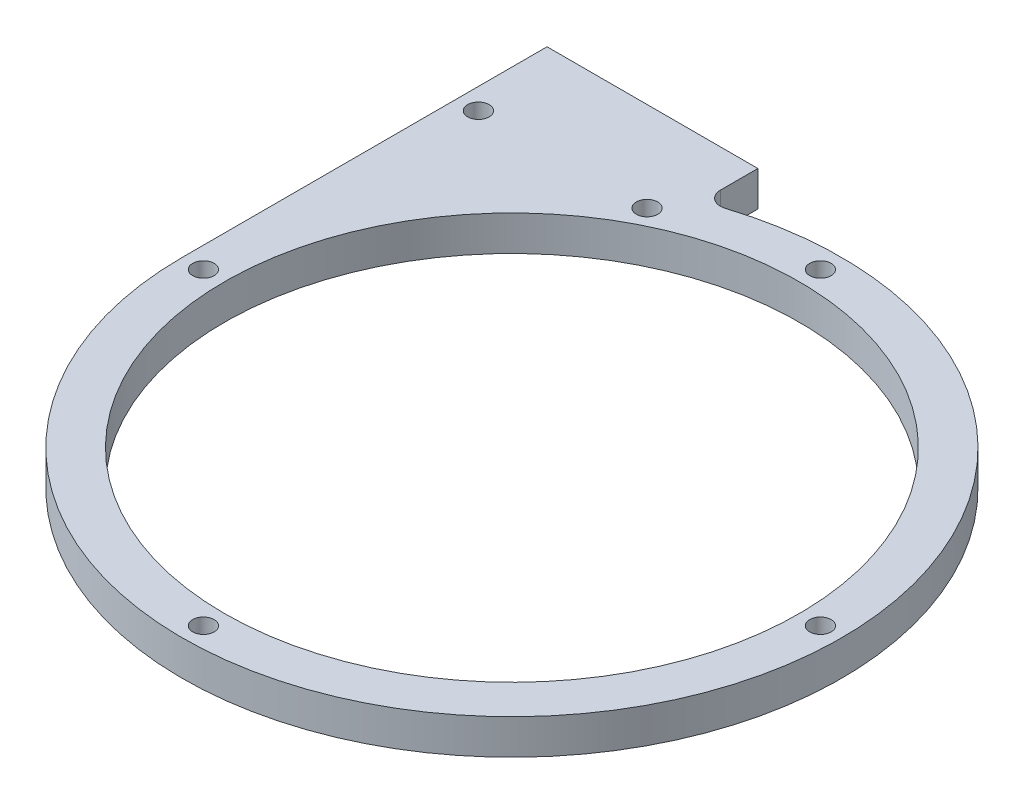
ISO-10303-21;
HEADER;
FILE_DESCRIPTION(('STEP AP214'),'2;1');
FILE_NAME('part.step','',(''),(''),'','','');
FILE_SCHEMA(('AUTOMOTIVE_DESIGN { 1 0 10303 214 1 1 1 1 }'));
ENDSEC;
DATA;
#1=APPLICATION_CONTEXT('core data for automotive mechanical design processes');
#2=APPLICATION_PROTOCOL_DEFINITION('international standard','automotive_design',2000,#1);
#3=PRODUCT_CONTEXT('',#1,'mechanical');
#4=PRODUCT('Part','Part','',(#3));
#5=PRODUCT_RELATED_PRODUCT_CATEGORY('part','',(#4));
#6=PRODUCT_DEFINITION_FORMATION('','',#4);
#7=PRODUCT_DEFINITION_CONTEXT('part definition',#1,'design');
#8=PRODUCT_DEFINITION('design','',#6,#7);
#9=PRODUCT_DEFINITION_SHAPE('','',#8);
#10=(LENGTH_UNIT() NAMED_UNIT(*) SI_UNIT(.MILLI.,.METRE.));
#11=(NAMED_UNIT(*) PLANE_ANGLE_UNIT() SI_UNIT($,.RADIAN.));
#12=(NAMED_UNIT(*) SI_UNIT($,.STERADIAN.) SOLID_ANGLE_UNIT());
#13=UNCERTAINTY_MEASURE_WITH_UNIT(LENGTH_MEASURE(1.E-05),#10,'distance_accuracy_value','');
#14=(GEOMETRIC_REPRESENTATION_CONTEXT(3) GLOBAL_UNCERTAINTY_ASSIGNED_CONTEXT((#13)) GLOBAL_UNIT_ASSIGNED_CONTEXT((#10,
#11,#12)) REPRESENTATION_CONTEXT('',''));
#15=CARTESIAN_POINT('',(0.,0.,0.));
#16=DIRECTION('',(0.,0.,1.));
#17=DIRECTION('',(1.,0.,0.));
#18=AXIS2_PLACEMENT_3D('',#15,#16,#17);
#19=CARTESIAN_POINT('',(0.,5.,0.));
#20=DIRECTION('',(0.,1.,0.));
#21=DIRECTION('',(0.,0.,1.));
#22=AXIS2_PLACEMENT_3D('',#19,#20,#21);
#23=PLANE('',#22);
#24=CARTESIAN_POINT('',(-43.9,5.,0.));
#25=DIRECTION('',(0.,1.,0.));
#26=DIRECTION('',(0.,0.,1.));
#27=AXIS2_PLACEMENT_3D('',#24,#25,#26);
#28=CIRCLE('',#27,1.525);
#29=CARTESIAN_POINT('',(-43.9,5.,1.525));
#30=VERTEX_POINT('',#29);
#31=EDGE_CURVE('E116',#30,#30,#28,.T.);
#32=ORIENTED_EDGE('',*,*,#31,.F.);
#33=EDGE_LOOP('',(#32));
#34=FACE_BOUND('',#33,.T.);
#35=CARTESIAN_POINT('',(43.9,5.,0.));
#36=DIRECTION('',(0.,1.,0.));
#37=DIRECTION('',(0.,0.,1.));
#38=AXIS2_PLACEMENT_3D('',#35,#36,#37);
#39=CIRCLE('',#38,1.525);
#40=CARTESIAN_POINT('',(43.9,5.,1.52500000000001));
#41=VERTEX_POINT('',#40);
#42=EDGE_CURVE('E128',#41,#41,#39,.T.);
#43=ORIENTED_EDGE('',*,*,#42,.F.);
#44=EDGE_LOOP('',(#43));
#45=FACE_BOUND('',#44,.T.);
#46=CARTESIAN_POINT('',(-19.9,5.,-39.1305507244659));
#47=DIRECTION('',(0.,1.,0.));
#48=DIRECTION('',(0.,0.,1.));
#49=AXIS2_PLACEMENT_3D('',#46,#47,#48);
#50=CIRCLE('',#49,1.525);
#51=CARTESIAN_POINT('',(-19.9,5.,-37.6055507244659));
#52=VERTEX_POINT('',#51);
#53=EDGE_CURVE('E140',#52,#52,#50,.T.);
#54=ORIENTED_EDGE('',*,*,#53,.F.);
#55=EDGE_LOOP('',(#54));
#56=FACE_BOUND('',#55,.T.);
#57=CARTESIAN_POINT('',(0.,5.,0.));
#58=DIRECTION('',(0.,1.,0.));
#59=DIRECTION('',(0.,0.,1.));
#60=AXIS2_PLACEMENT_3D('',#57,#58,#59);
#61=CIRCLE('',#60,46.9);
#62=CARTESIAN_POINT('',(-46.9,5.,0.));
#63=VERTEX_POINT('',#62);
#64=CARTESIAN_POINT('',(-14.2905930470348,5.,-44.6697766992856));
#65=VERTEX_POINT('',#64);
#66=EDGE_CURVE('E152',#63,#65,#61,.T.);
#67=ORIENTED_EDGE('',*,*,#66,.T.);
#68=CARTESIAN_POINT('',(-14.9,5.,-46.5746712280398));
#69=DIRECTION('',(0.,-1.,0.));
#70=DIRECTION('',(0.,0.,1.));
#71=AXIS2_PLACEMENT_3D('',#68,#69,#70);
#72=CIRCLE('',#71,2.00000000000001);
#73=CARTESIAN_POINT('',(-16.9,5.,-46.5746712280398));
#74=VERTEX_POINT('',#73);
#75=EDGE_CURVE('E74',#65,#74,#72,.T.);
#76=ORIENTED_EDGE('',*,*,#75,.T.);
#77=DIRECTION('',(0.,0.,-1.));
#78=VECTOR('',#77,1.);
#79=CARTESIAN_POINT('',(-16.9,5.,-46.9));
#80=LINE('',#79,#78);
#81=CARTESIAN_POINT('',(-16.9,5.,-51.9));
#82=VERTEX_POINT('',#81);
#83=EDGE_CURVE('E85',#74,#82,#80,.T.);
#84=ORIENTED_EDGE('',*,*,#83,.T.);
#85=DIRECTION('',(-1.,0.,0.));
#86=VECTOR('',#85,1.);
#87=CARTESIAN_POINT('',(-46.9,5.,-51.9));
#88=LINE('',#87,#86);
#89=CARTESIAN_POINT('',(-46.9,5.,-51.9));
#90=VERTEX_POINT('',#89);
#91=EDGE_CURVE('E89',#82,#90,#88,.T.);
#92=ORIENTED_EDGE('',*,*,#91,.T.);
#93=DIRECTION('',(0.,0.,1.));
#94=VECTOR('',#93,1.);
#95=CARTESIAN_POINT('',(-46.9,5.,0.));
#96=LINE('',#95,#94);
#97=EDGE_CURVE('E51',#90,#63,#96,.T.);
#98=ORIENTED_EDGE('',*,*,#97,.T.);
#99=EDGE_LOOP('',(#67,#76,#84,#92,#98));
#100=FACE_BOUND('',#99,.T.);
#101=CARTESIAN_POINT('',(0.,5.,0.));
#102=DIRECTION('',(0.,1.,0.));
#103=DIRECTION('',(0.,0.,1.));
#104=AXIS2_PLACEMENT_3D('',#101,#102,#103);
#105=CIRCLE('',#104,40.9);
#106=CARTESIAN_POINT('',(0.,5.,40.9));
#107=VERTEX_POINT('',#106);
#108=EDGE_CURVE('E146',#107,#107,#105,.T.);
#109=ORIENTED_EDGE('',*,*,#108,.F.);
#110=EDGE_LOOP('',(#109));
#111=FACE_BOUND('',#110,.T.);
#112=CARTESIAN_POINT('',(0.,5.,-43.9));
#113=DIRECTION('',(0.,1.,0.));
#114=DIRECTION('',(0.,0.,1.));
#115=AXIS2_PLACEMENT_3D('',#112,#113,#114);
#116=CIRCLE('',#115,1.525);
#117=CARTESIAN_POINT('',(0.,5.,-42.375));
#118=VERTEX_POINT('',#117);
#119=EDGE_CURVE('E134',#118,#118,#116,.T.);
#120=ORIENTED_EDGE('',*,*,#119,.F.);
#121=EDGE_LOOP('',(#120));
#122=FACE_BOUND('',#121,.T.);
#123=CARTESIAN_POINT('',(0.,5.,43.9));
#124=DIRECTION('',(0.,1.,0.));
#125=DIRECTION('',(0.,0.,1.));
#126=AXIS2_PLACEMENT_3D('',#123,#124,#125);
#127=CIRCLE('',#126,1.525);
#128=CARTESIAN_POINT('',(0.,5.,45.425));
#129=VERTEX_POINT('',#128);
#130=EDGE_CURVE('E122',#129,#129,#127,.T.);
#131=ORIENTED_EDGE('',*,*,#130,.F.);
#132=EDGE_LOOP('',(#131));
#133=FACE_BOUND('',#132,.T.);
#134=CARTESIAN_POINT('',(-43.9,5.,-39.1305507244659));
#135=DIRECTION('',(0.,1.,0.));
#136=DIRECTION('',(0.,0.,1.));
#137=AXIS2_PLACEMENT_3D('',#134,#135,#136);
#138=CIRCLE('',#137,1.525);
#139=CARTESIAN_POINT('',(-43.9,5.,-37.6055507244659));
#140=VERTEX_POINT('',#139);
#141=EDGE_CURVE('E110',#140,#140,#138,.T.);
#142=ORIENTED_EDGE('',*,*,#141,.F.);
#143=EDGE_LOOP('',(#142));
#144=FACE_BOUND('',#143,.T.);
#145=ADVANCED_FACE('F34',(#34,#45,#56,#100,#111,#122,#133,#144),#23,.T.);
#146=CARTESIAN_POINT('',(0.,0.,0.));
#147=DIRECTION('',(0.,1.,0.));
#148=DIRECTION('',(0.,0.,1.));
#149=AXIS2_PLACEMENT_3D('',#146,#147,#148);
#150=PLANE('',#149);
#151=CARTESIAN_POINT('',(0.,0.,0.));
#152=DIRECTION('',(0.,1.,0.));
#153=DIRECTION('',(0.,0.,1.));
#154=AXIS2_PLACEMENT_3D('',#151,#152,#153);
#155=CIRCLE('',#154,46.9);
#156=CARTESIAN_POINT('',(-46.9,0.,0.));
#157=VERTEX_POINT('',#156);
#158=CARTESIAN_POINT('',(-14.2905930470348,0.,-44.6697766992856));
#159=VERTEX_POINT('',#158);
#160=EDGE_CURVE('E149',#157,#159,#155,.T.);
#161=ORIENTED_EDGE('',*,*,#160,.F.);
#162=DIRECTION('',(0.,0.,1.));
#163=VECTOR('',#162,1.);
#164=CARTESIAN_POINT('',(-46.9,0.,0.));
#165=LINE('',#164,#163);
#166=CARTESIAN_POINT('',(-46.9,0.,-51.9));
#167=VERTEX_POINT('',#166);
#168=EDGE_CURVE('E71',#167,#157,#165,.T.);
#169=ORIENTED_EDGE('',*,*,#168,.F.);
#170=DIRECTION('',(-1.,0.,0.));
#171=VECTOR('',#170,1.);
#172=CARTESIAN_POINT('',(-46.9,0.,-51.9));
#173=LINE('',#172,#171);
#174=CARTESIAN_POINT('',(-16.9,0.,-51.9));
#175=VERTEX_POINT('',#174);
#176=EDGE_CURVE('E105',#175,#167,#173,.T.);
#177=ORIENTED_EDGE('',*,*,#176,.F.);
#178=DIRECTION('',(0.,0.,-1.));
#179=VECTOR('',#178,1.);
#180=CARTESIAN_POINT('',(-16.9,0.,-46.9));
#181=LINE('',#180,#179);
#182=CARTESIAN_POINT('',(-16.9,0.,-46.5746712280398));
#183=VERTEX_POINT('',#182);
#184=EDGE_CURVE('E97',#183,#175,#181,.T.);
#185=ORIENTED_EDGE('',*,*,#184,.F.);
#186=CARTESIAN_POINT('',(-14.9,0.,-46.5746712280398));
#187=DIRECTION('',(0.,-1.,0.));
#188=DIRECTION('',(0.,0.,1.));
#189=AXIS2_PLACEMENT_3D('',#186,#187,#188);
#190=CIRCLE('',#189,2.00000000000001);
#191=EDGE_CURVE('E65',#159,#183,#190,.T.);
#192=ORIENTED_EDGE('',*,*,#191,.F.);
#193=EDGE_LOOP('',(#161,#169,#177,#185,#192));
#194=FACE_BOUND('',#193,.T.);
#195=CARTESIAN_POINT('',(0.,0.,0.));
#196=DIRECTION('',(0.,1.,0.));
#197=DIRECTION('',(0.,0.,1.));
#198=AXIS2_PLACEMENT_3D('',#195,#196,#197);
#199=CIRCLE('',#198,40.9);
#200=CARTESIAN_POINT('',(0.,0.,40.9));
#201=VERTEX_POINT('',#200);
#202=EDGE_CURVE('E143',#201,#201,#199,.T.);
#203=ORIENTED_EDGE('',*,*,#202,.T.);
#204=EDGE_LOOP('',(#203));
#205=FACE_BOUND('',#204,.T.);
#206=CARTESIAN_POINT('',(-19.9,0.,-39.1305507244659));
#207=DIRECTION('',(0.,1.,0.));
#208=DIRECTION('',(0.,0.,1.));
#209=AXIS2_PLACEMENT_3D('',#206,#207,#208);
#210=CIRCLE('',#209,1.525);
#211=CARTESIAN_POINT('',(-19.9,0.,-37.6055507244659));
#212=VERTEX_POINT('',#211);
#213=EDGE_CURVE('E137',#212,#212,#210,.T.);
#214=ORIENTED_EDGE('',*,*,#213,.T.);
#215=EDGE_LOOP('',(#214));
#216=FACE_BOUND('',#215,.T.);
#217=CARTESIAN_POINT('',(0.,0.,-43.9));
#218=DIRECTION('',(0.,1.,0.));
#219=DIRECTION('',(0.,0.,1.));
#220=AXIS2_PLACEMENT_3D('',#217,#218,#219);
#221=CIRCLE('',#220,1.525);
#222=CARTESIAN_POINT('',(0.,0.,-42.375));
#223=VERTEX_POINT('',#222);
#224=EDGE_CURVE('E131',#223,#223,#221,.T.);
#225=ORIENTED_EDGE('',*,*,#224,.T.);
#226=EDGE_LOOP('',(#225));
#227=FACE_BOUND('',#226,.T.);
#228=CARTESIAN_POINT('',(43.9,0.,0.));
#229=DIRECTION('',(0.,1.,0.));
#230=DIRECTION('',(0.,0.,1.));
#231=AXIS2_PLACEMENT_3D('',#228,#229,#230);
#232=CIRCLE('',#231,1.525);
#233=CARTESIAN_POINT('',(43.9,0.,1.52500000000001));
#234=VERTEX_POINT('',#233);
#235=EDGE_CURVE('E125',#234,#234,#232,.T.);
#236=ORIENTED_EDGE('',*,*,#235,.T.);
#237=EDGE_LOOP('',(#236));
#238=FACE_BOUND('',#237,.T.);
#239=CARTESIAN_POINT('',(0.,0.,43.9));
#240=DIRECTION('',(0.,1.,0.));
#241=DIRECTION('',(0.,0.,1.));
#242=AXIS2_PLACEMENT_3D('',#239,#240,#241);
#243=CIRCLE('',#242,1.525);
#244=CARTESIAN_POINT('',(0.,0.,45.425));
#245=VERTEX_POINT('',#244);
#246=EDGE_CURVE('E119',#245,#245,#243,.T.);
#247=ORIENTED_EDGE('',*,*,#246,.T.);
#248=EDGE_LOOP('',(#247));
#249=FACE_BOUND('',#248,.T.);
#250=CARTESIAN_POINT('',(-43.9,0.,0.));
#251=DIRECTION('',(0.,1.,0.));
#252=DIRECTION('',(0.,0.,1.));
#253=AXIS2_PLACEMENT_3D('',#250,#251,#252);
#254=CIRCLE('',#253,1.525);
#255=CARTESIAN_POINT('',(-43.9,0.,1.525));
#256=VERTEX_POINT('',#255);
#257=EDGE_CURVE('E113',#256,#256,#254,.T.);
#258=ORIENTED_EDGE('',*,*,#257,.T.);
#259=EDGE_LOOP('',(#258));
#260=FACE_BOUND('',#259,.T.);
#261=CARTESIAN_POINT('',(-43.9,0.,-39.1305507244659));
#262=DIRECTION('',(0.,1.,0.));
#263=DIRECTION('',(0.,0.,1.));
#264=AXIS2_PLACEMENT_3D('',#261,#262,#263);
#265=CIRCLE('',#264,1.525);
#266=CARTESIAN_POINT('',(-43.9,0.,-37.6055507244659));
#267=VERTEX_POINT('',#266);
#268=EDGE_CURVE('E101',#267,#267,#265,.T.);
#269=ORIENTED_EDGE('',*,*,#268,.T.);
#270=EDGE_LOOP('',(#269));
#271=FACE_BOUND('',#270,.T.);
#272=ADVANCED_FACE('F164',(#194,#205,#216,#227,#238,#249,#260,#271),#150,.F.);
#273=CARTESIAN_POINT('',(0.,5.,0.));
#274=DIRECTION('',(0.,-1.,0.));
#275=DIRECTION('',(0.,0.,-1.));
#276=AXIS2_PLACEMENT_3D('',#273,#274,#275);
#277=CYLINDRICAL_SURFACE('',#276,46.9);
#278=ORIENTED_EDGE('',*,*,#160,.T.);
#279=DIRECTION('',(0.,-1.,0.));
#280=VECTOR('',#279,1.);
#281=CARTESIAN_POINT('',(-14.2905930470348,5.,-44.6697766992856));
#282=LINE('',#281,#280);
#283=EDGE_CURVE('E11',#65,#159,#282,.T.);
#284=ORIENTED_EDGE('',*,*,#283,.F.);
#285=ORIENTED_EDGE('',*,*,#66,.F.);
#286=DIRECTION('',(0.,-1.,0.));
#287=VECTOR('',#286,1.);
#288=CARTESIAN_POINT('',(-46.9,5.,0.));
#289=LINE('',#288,#287);
#290=EDGE_CURVE('E156',#63,#157,#289,.T.);
#291=ORIENTED_EDGE('',*,*,#290,.T.);
#292=EDGE_LOOP('',(#278,#284,#285,#291));
#293=FACE_BOUND('',#292,.T.);
#294=ADVANCED_FACE('F36',(#293),#277,.T.);
#295=CARTESIAN_POINT('',(-14.9,5.,-46.5746712280398));
#296=DIRECTION('',(0.,-1.,0.));
#297=DIRECTION('',(0.,0.,-1.));
#298=AXIS2_PLACEMENT_3D('',#295,#296,#297);
#299=CYLINDRICAL_SURFACE('',#298,2.00000000000001);
#300=ORIENTED_EDGE('',*,*,#191,.T.);
#301=DIRECTION('',(0.,-1.,0.));
#302=VECTOR('',#301,1.);
#303=CARTESIAN_POINT('',(-16.9,5.,-46.5746712280398));
#304=LINE('',#303,#302);
#305=EDGE_CURVE('E43',#74,#183,#304,.T.);
#306=ORIENTED_EDGE('',*,*,#305,.F.);
#307=ORIENTED_EDGE('',*,*,#75,.F.);
#308=ORIENTED_EDGE('',*,*,#283,.T.);
#309=EDGE_LOOP('',(#300,#306,#307,#308));
#310=FACE_BOUND('',#309,.T.);
#311=ADVANCED_FACE('F170',(#310),#299,.F.);
#312=CARTESIAN_POINT('',(-16.9,5.,-46.9));
#313=DIRECTION('',(-1.,0.,0.));
#314=DIRECTION('',(0.,0.,1.));
#315=AXIS2_PLACEMENT_3D('',#312,#313,#314);
#316=PLANE('',#315);
#317=ORIENTED_EDGE('',*,*,#184,.T.);
#318=DIRECTION('',(0.,-1.,0.));
#319=VECTOR('',#318,1.);
#320=CARTESIAN_POINT('',(-16.9,5.,-51.9));
#321=LINE('',#320,#319);
#322=EDGE_CURVE('E94',#82,#175,#321,.T.);
#323=ORIENTED_EDGE('',*,*,#322,.F.);
#324=ORIENTED_EDGE('',*,*,#83,.F.);
#325=ORIENTED_EDGE('',*,*,#305,.T.);
#326=EDGE_LOOP('',(#317,#323,#324,#325));
#327=FACE_BOUND('',#326,.T.);
#328=ADVANCED_FACE('F95',(#327),#316,.F.);
#329=CARTESIAN_POINT('',(-46.9,5.,0.));
#330=DIRECTION('',(1.,0.,0.));
#331=DIRECTION('',(0.,0.,-1.));
#332=AXIS2_PLACEMENT_3D('',#329,#330,#331);
#333=PLANE('',#332);
#334=ORIENTED_EDGE('',*,*,#168,.T.);
#335=ORIENTED_EDGE('',*,*,#290,.F.);
#336=ORIENTED_EDGE('',*,*,#97,.F.);
#337=DIRECTION('',(0.,-1.,0.));
#338=VECTOR('',#337,1.);
#339=CARTESIAN_POINT('',(-46.9,5.,-51.9));
#340=LINE('',#339,#338);
#341=EDGE_CURVE('E102',#90,#167,#340,.T.);
#342=ORIENTED_EDGE('',*,*,#341,.T.);
#343=EDGE_LOOP('',(#334,#335,#336,#342));
#344=FACE_BOUND('',#343,.T.);
#345=ADVANCED_FACE('F166',(#344),#333,.F.);
#346=CARTESIAN_POINT('',(0.,5.,0.));
#347=DIRECTION('',(0.,-1.,0.));
#348=DIRECTION('',(0.,0.,-1.));
#349=AXIS2_PLACEMENT_3D('',#346,#347,#348);
#350=CYLINDRICAL_SURFACE('',#349,40.9);
#351=ORIENTED_EDGE('',*,*,#108,.T.);
#352=EDGE_LOOP('',(#351));
#353=FACE_BOUND('',#352,.T.);
#354=ORIENTED_EDGE('',*,*,#202,.F.);
#355=EDGE_LOOP('',(#354));
#356=FACE_BOUND('',#355,.T.);
#357=ADVANCED_FACE('F187',(#353,#356),#350,.F.);
#358=CARTESIAN_POINT('',(-19.9,5.,-39.1305507244659));
#359=DIRECTION('',(0.,-1.,0.));
#360=DIRECTION('',(0.,0.,-1.));
#361=AXIS2_PLACEMENT_3D('',#358,#359,#360);
#362=CYLINDRICAL_SURFACE('',#361,1.525);
#363=ORIENTED_EDGE('',*,*,#53,.T.);
#364=EDGE_LOOP('',(#363));
#365=FACE_BOUND('',#364,.T.);
#366=ORIENTED_EDGE('',*,*,#213,.F.);
#367=EDGE_LOOP('',(#366));
#368=FACE_BOUND('',#367,.T.);
#369=ADVANCED_FACE('F194',(#365,#368),#362,.F.);
#370=CARTESIAN_POINT('',(0.,5.,-43.9));
#371=DIRECTION('',(0.,-1.,0.));
#372=DIRECTION('',(0.,0.,-1.));
#373=AXIS2_PLACEMENT_3D('',#370,#371,#372);
#374=CYLINDRICAL_SURFACE('',#373,1.525);
#375=ORIENTED_EDGE('',*,*,#119,.T.);
#376=EDGE_LOOP('',(#375));
#377=FACE_BOUND('',#376,.T.);
#378=ORIENTED_EDGE('',*,*,#224,.F.);
#379=EDGE_LOOP('',(#378));
#380=FACE_BOUND('',#379,.T.);
#381=ADVANCED_FACE('F199',(#377,#380),#374,.F.);
#382=CARTESIAN_POINT('',(43.9,5.,0.));
#383=DIRECTION('',(0.,-1.,0.));
#384=DIRECTION('',(0.,0.,-1.));
#385=AXIS2_PLACEMENT_3D('',#382,#383,#384);
#386=CYLINDRICAL_SURFACE('',#385,1.525);
#387=ORIENTED_EDGE('',*,*,#42,.T.);
#388=EDGE_LOOP('',(#387));
#389=FACE_BOUND('',#388,.T.);
#390=ORIENTED_EDGE('',*,*,#235,.F.);
#391=EDGE_LOOP('',(#390));
#392=FACE_BOUND('',#391,.T.);
#393=ADVANCED_FACE('F233',(#389,#392),#386,.F.);
#394=CARTESIAN_POINT('',(0.,5.,43.9));
#395=DIRECTION('',(0.,-1.,0.));
#396=DIRECTION('',(0.,0.,-1.));
#397=AXIS2_PLACEMENT_3D('',#394,#395,#396);
#398=CYLINDRICAL_SURFACE('',#397,1.525);
#399=ORIENTED_EDGE('',*,*,#130,.T.);
#400=EDGE_LOOP('',(#399));
#401=FACE_BOUND('',#400,.T.);
#402=ORIENTED_EDGE('',*,*,#246,.F.);
#403=EDGE_LOOP('',(#402));
#404=FACE_BOUND('',#403,.T.);
#405=ADVANCED_FACE('F227',(#401,#404),#398,.F.);
#406=CARTESIAN_POINT('',(-43.9,5.,0.));
#407=DIRECTION('',(0.,-1.,0.));
#408=DIRECTION('',(0.,0.,-1.));
#409=AXIS2_PLACEMENT_3D('',#406,#407,#408);
#410=CYLINDRICAL_SURFACE('',#409,1.525);
#411=ORIENTED_EDGE('',*,*,#31,.T.);
#412=EDGE_LOOP('',(#411));
#413=FACE_BOUND('',#412,.T.);
#414=ORIENTED_EDGE('',*,*,#257,.F.);
#415=EDGE_LOOP('',(#414));
#416=FACE_BOUND('',#415,.T.);
#417=ADVANCED_FACE('F219',(#413,#416),#410,.F.);
#418=CARTESIAN_POINT('',(-43.9,5.,-39.1305507244659));
#419=DIRECTION('',(0.,-1.,0.));
#420=DIRECTION('',(0.,0.,-1.));
#421=AXIS2_PLACEMENT_3D('',#418,#419,#420);
#422=CYLINDRICAL_SURFACE('',#421,1.525);
#423=ORIENTED_EDGE('',*,*,#141,.T.);
#424=EDGE_LOOP('',(#423));
#425=FACE_BOUND('',#424,.T.);
#426=ORIENTED_EDGE('',*,*,#268,.F.);
#427=EDGE_LOOP('',(#426));
#428=FACE_BOUND('',#427,.T.);
#429=ADVANCED_FACE('F217',(#425,#428),#422,.F.);
#430=CARTESIAN_POINT('',(-46.9,5.,-51.9));
#431=DIRECTION('',(0.,0.,1.));
#432=DIRECTION('',(1.,0.,0.));
#433=AXIS2_PLACEMENT_3D('',#430,#431,#432);
#434=PLANE('',#433);
#435=ORIENTED_EDGE('',*,*,#176,.T.);
#436=ORIENTED_EDGE('',*,*,#341,.F.);
#437=ORIENTED_EDGE('',*,*,#91,.F.);
#438=ORIENTED_EDGE('',*,*,#322,.T.);
#439=EDGE_LOOP('',(#435,#436,#437,#438));
#440=FACE_BOUND('',#439,.T.);
#441=ADVANCED_FACE('F104',(#440),#434,.F.);
#442=CLOSED_SHELL('',(#145,#272,#294,#311,#328,#345,#357,#369,#381,#393,#405,#417,#429,#441));
#443=MANIFOLD_SOLID_BREP('B2',#442);
#444=ADVANCED_BREP_SHAPE_REPRESENTATION('',(#18,#443),#14);
#445=SHAPE_DEFINITION_REPRESENTATION(#9,#444);
ENDSEC;
END-ISO-10303-21;
